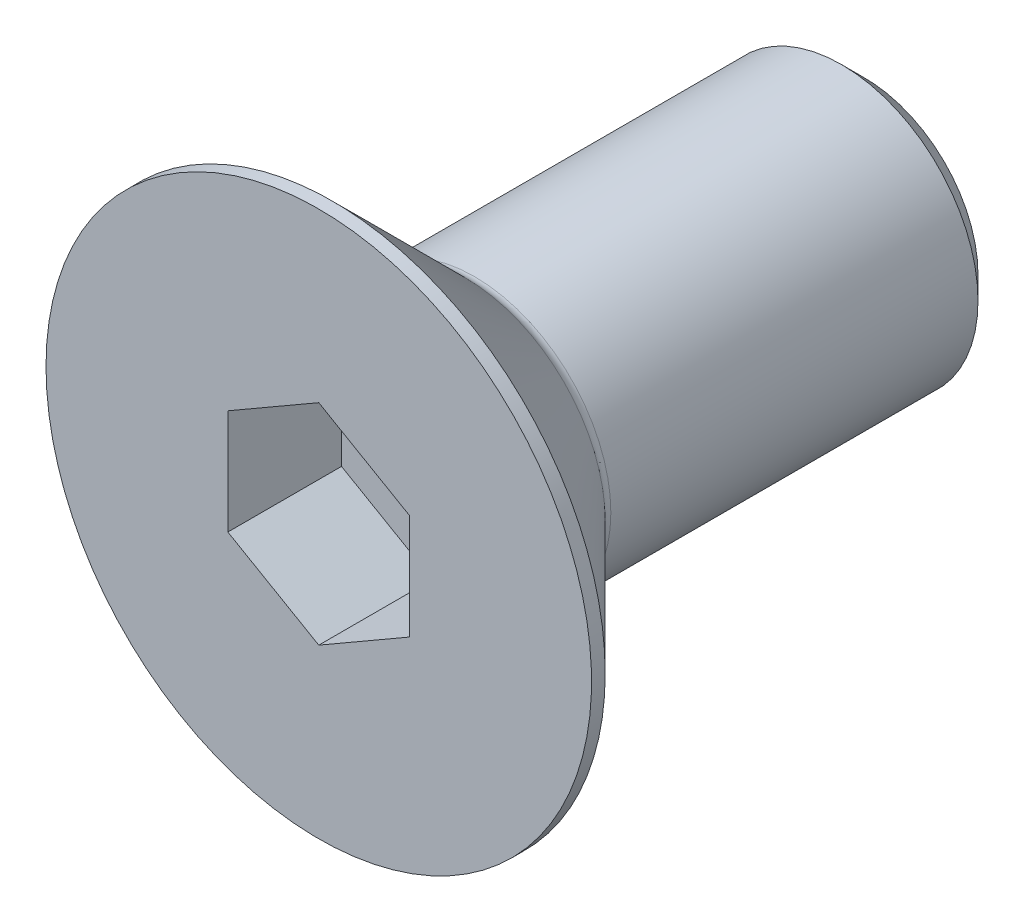
ISO-10303-21;
HEADER;
FILE_DESCRIPTION(('STEP AP214'),'2;1');
FILE_NAME('part.step','',(''),(''),'','','');
FILE_SCHEMA(('AUTOMOTIVE_DESIGN { 1 0 10303 214 1 1 1 1 }'));
ENDSEC;
DATA;
#1=APPLICATION_CONTEXT('core data for automotive mechanical design processes');
#2=APPLICATION_PROTOCOL_DEFINITION('international standard','automotive_design',2000,#1);
#3=PRODUCT_CONTEXT('',#1,'mechanical');
#4=PRODUCT('Part','Part','',(#3));
#5=PRODUCT_RELATED_PRODUCT_CATEGORY('part','',(#4));
#6=PRODUCT_DEFINITION_FORMATION('','',#4);
#7=PRODUCT_DEFINITION_CONTEXT('part definition',#1,'design');
#8=PRODUCT_DEFINITION('design','',#6,#7);
#9=PRODUCT_DEFINITION_SHAPE('','',#8);
#10=(LENGTH_UNIT() NAMED_UNIT(*) SI_UNIT(.MILLI.,.METRE.));
#11=(NAMED_UNIT(*) PLANE_ANGLE_UNIT() SI_UNIT($,.RADIAN.));
#12=(NAMED_UNIT(*) SI_UNIT($,.STERADIAN.) SOLID_ANGLE_UNIT());
#13=UNCERTAINTY_MEASURE_WITH_UNIT(LENGTH_MEASURE(1.E-05),#10,'distance_accuracy_value','');
#14=(GEOMETRIC_REPRESENTATION_CONTEXT(3) GLOBAL_UNCERTAINTY_ASSIGNED_CONTEXT((#13)) GLOBAL_UNIT_ASSIGNED_CONTEXT((#10,
#11,#12)) REPRESENTATION_CONTEXT('',''));
#15=CARTESIAN_POINT('',(0.,0.,0.));
#16=DIRECTION('',(0.,0.,1.));
#17=DIRECTION('',(1.,0.,0.));
#18=AXIS2_PLACEMENT_3D('',#15,#16,#17);
#19=CARTESIAN_POINT('',(0.,0.,-2.5));
#20=DIRECTION('',(0.,0.,1.));
#21=DIRECTION('',(1.,0.,0.));
#22=AXIS2_PLACEMENT_3D('',#19,#20,#21);
#23=PLANE('',#22);
#24=DIRECTION('',(-0.866025403784439,-0.5,0.));
#25=VECTOR('',#24,1.);
#26=CARTESIAN_POINT('',(0.,2.3094010767585,-2.5));
#27=LINE('',#26,#25);
#28=CARTESIAN_POINT('',(0.,2.3094010767585,-2.5));
#29=VERTEX_POINT('',#28);
#30=CARTESIAN_POINT('',(-2.,1.15470053837925,-2.5));
#31=VERTEX_POINT('',#30);
#32=EDGE_CURVE('E83',#29,#31,#27,.T.);
#33=ORIENTED_EDGE('',*,*,#32,.T.);
#34=DIRECTION('',(0.,1.,0.));
#35=VECTOR('',#34,1.);
#36=CARTESIAN_POINT('',(-2.,1.15470053837925,-2.5));
#37=LINE('',#36,#35);
#38=CARTESIAN_POINT('',(-2.,-1.15470053837925,-2.5));
#39=VERTEX_POINT('',#38);
#40=EDGE_CURVE('E67',#31,#39,#37,.F.);
#41=ORIENTED_EDGE('',*,*,#40,.T.);
#42=DIRECTION('',(0.866025403784439,-0.499999999999999,0.));
#43=VECTOR('',#42,1.);
#44=CARTESIAN_POINT('',(-2.,-1.15470053837925,-2.5));
#45=LINE('',#44,#43);
#46=CARTESIAN_POINT('',(0.,-2.3094010767585,-2.5));
#47=VERTEX_POINT('',#46);
#48=EDGE_CURVE('E72',#39,#47,#45,.T.);
#49=ORIENTED_EDGE('',*,*,#48,.T.);
#50=DIRECTION('',(0.866025403784439,0.5,0.));
#51=VECTOR('',#50,1.);
#52=CARTESIAN_POINT('',(0.,-2.3094010767585,-2.5));
#53=LINE('',#52,#51);
#54=CARTESIAN_POINT('',(2.,-1.15470053837925,-2.5));
#55=VERTEX_POINT('',#54);
#56=EDGE_CURVE('E129',#47,#55,#53,.T.);
#57=ORIENTED_EDGE('',*,*,#56,.T.);
#58=DIRECTION('',(0.,1.,0.));
#59=VECTOR('',#58,1.);
#60=CARTESIAN_POINT('',(2.,-1.15470053837925,-2.5));
#61=LINE('',#60,#59);
#62=CARTESIAN_POINT('',(2.,1.15470053837925,-2.5));
#63=VERTEX_POINT('',#62);
#64=EDGE_CURVE('E133',#55,#63,#61,.T.);
#65=ORIENTED_EDGE('',*,*,#64,.T.);
#66=DIRECTION('',(-0.866025403784439,0.499999999999999,0.));
#67=VECTOR('',#66,1.);
#68=CARTESIAN_POINT('',(2.,1.15470053837925,-2.5));
#69=LINE('',#68,#67);
#70=EDGE_CURVE('E138',#63,#29,#69,.T.);
#71=ORIENTED_EDGE('',*,*,#70,.T.);
#72=EDGE_LOOP('',(#33,#41,#49,#57,#65,#71));
#73=FACE_BOUND('',#72,.T.);
#74=ADVANCED_FACE('F16',(#73),#23,.T.);
#75=CARTESIAN_POINT('',(-2.,-1.15470053837925,0.));
#76=DIRECTION('',(-0.499999999999999,-0.866025403784439,0.));
#77=DIRECTION('',(0.866025403784439,-0.499999999999999,0.));
#78=AXIS2_PLACEMENT_3D('',#75,#76,#77);
#79=PLANE('',#78);
#80=DIRECTION('',(0.,0.,1.));
#81=VECTOR('',#80,1.);
#82=CARTESIAN_POINT('',(-2.,-1.15470053837925,0.));
#83=LINE('',#82,#81);
#84=CARTESIAN_POINT('',(-2.,-1.15470053837925,0.));
#85=VERTEX_POINT('',#84);
#86=EDGE_CURVE('E74',#39,#85,#83,.T.);
#87=ORIENTED_EDGE('',*,*,#86,.T.);
#88=DIRECTION('',(-0.866025403784439,0.499999999999999,0.));
#89=VECTOR('',#88,1.);
#90=CARTESIAN_POINT('',(0.,-2.3094010767585,0.));
#91=LINE('',#90,#89);
#92=CARTESIAN_POINT('',(0.,-2.3094010767585,0.));
#93=VERTEX_POINT('',#92);
#94=EDGE_CURVE('E127',#93,#85,#91,.T.);
#95=ORIENTED_EDGE('',*,*,#94,.F.);
#96=DIRECTION('',(0.,0.,1.));
#97=VECTOR('',#96,1.);
#98=CARTESIAN_POINT('',(0.,-2.3094010767585,0.));
#99=LINE('',#98,#97);
#100=EDGE_CURVE('E77',#93,#47,#99,.F.);
#101=ORIENTED_EDGE('',*,*,#100,.T.);
#102=ORIENTED_EDGE('',*,*,#48,.F.);
#103=EDGE_LOOP('',(#87,#95,#101,#102));
#104=FACE_BOUND('',#103,.T.);
#105=ADVANCED_FACE('F73',(#104),#79,.F.);
#106=CARTESIAN_POINT('',(-2.,1.15470053837925,0.));
#107=DIRECTION('',(-1.,0.,0.));
#108=DIRECTION('',(0.,0.,1.));
#109=AXIS2_PLACEMENT_3D('',#106,#107,#108);
#110=PLANE('',#109);
#111=DIRECTION('',(0.,0.,1.));
#112=VECTOR('',#111,1.);
#113=CARTESIAN_POINT('',(-2.,1.15470053837925,0.));
#114=LINE('',#113,#112);
#115=CARTESIAN_POINT('',(-2.,1.15470053837925,0.));
#116=VERTEX_POINT('',#115);
#117=EDGE_CURVE('E85',#31,#116,#114,.T.);
#118=ORIENTED_EDGE('',*,*,#117,.T.);
#119=DIRECTION('',(0.,1.,0.));
#120=VECTOR('',#119,1.);
#121=CARTESIAN_POINT('',(-2.,0.,0.));
#122=LINE('',#121,#120);
#123=EDGE_CURVE('E89',#85,#116,#122,.T.);
#124=ORIENTED_EDGE('',*,*,#123,.F.);
#125=ORIENTED_EDGE('',*,*,#86,.F.);
#126=ORIENTED_EDGE('',*,*,#40,.F.);
#127=EDGE_LOOP('',(#118,#124,#125,#126));
#128=FACE_BOUND('',#127,.T.);
#129=ADVANCED_FACE('F87',(#128),#110,.F.);
#130=CARTESIAN_POINT('',(0.,2.3094010767585,0.));
#131=DIRECTION('',(-0.5,0.866025403784439,0.));
#132=DIRECTION('',(-0.866025403784439,-0.5,0.));
#133=AXIS2_PLACEMENT_3D('',#130,#131,#132);
#134=PLANE('',#133);
#135=DIRECTION('',(0.,0.,1.));
#136=VECTOR('',#135,1.);
#137=CARTESIAN_POINT('',(0.,2.3094010767585,0.));
#138=LINE('',#137,#136);
#139=CARTESIAN_POINT('',(0.,2.3094010767585,0.));
#140=VERTEX_POINT('',#139);
#141=EDGE_CURVE('E140',#29,#140,#138,.T.);
#142=ORIENTED_EDGE('',*,*,#141,.T.);
#143=DIRECTION('',(0.866025403784439,0.5,0.));
#144=VECTOR('',#143,1.);
#145=CARTESIAN_POINT('',(-2.,1.15470053837925,0.));
#146=LINE('',#145,#144);
#147=EDGE_CURVE('E123',#116,#140,#146,.T.);
#148=ORIENTED_EDGE('',*,*,#147,.F.);
#149=ORIENTED_EDGE('',*,*,#117,.F.);
#150=ORIENTED_EDGE('',*,*,#32,.F.);
#151=EDGE_LOOP('',(#142,#148,#149,#150));
#152=FACE_BOUND('',#151,.T.);
#153=ADVANCED_FACE('F144',(#152),#134,.F.);
#154=CARTESIAN_POINT('',(2.,1.15470053837925,0.));
#155=DIRECTION('',(0.499999999999999,0.866025403784439,0.));
#156=DIRECTION('',(-0.866025403784439,0.499999999999999,0.));
#157=AXIS2_PLACEMENT_3D('',#154,#155,#156);
#158=PLANE('',#157);
#159=DIRECTION('',(0.,0.,-1.));
#160=VECTOR('',#159,1.);
#161=CARTESIAN_POINT('',(2.,1.15470053837925,0.));
#162=LINE('',#161,#160);
#163=CARTESIAN_POINT('',(2.,1.15470053837925,0.));
#164=VERTEX_POINT('',#163);
#165=EDGE_CURVE('E136',#63,#164,#162,.F.);
#166=ORIENTED_EDGE('',*,*,#165,.T.);
#167=DIRECTION('',(0.866025403784439,-0.499999999999999,0.));
#168=VECTOR('',#167,1.);
#169=CARTESIAN_POINT('',(0.,2.3094010767585,0.));
#170=LINE('',#169,#168);
#171=EDGE_CURVE('E120',#140,#164,#170,.T.);
#172=ORIENTED_EDGE('',*,*,#171,.F.);
#173=ORIENTED_EDGE('',*,*,#141,.F.);
#174=ORIENTED_EDGE('',*,*,#70,.F.);
#175=EDGE_LOOP('',(#166,#172,#173,#174));
#176=FACE_BOUND('',#175,.T.);
#177=ADVANCED_FACE('F155',(#176),#158,.F.);
#178=CARTESIAN_POINT('',(2.,-1.15470053837925,0.));
#179=DIRECTION('',(1.,0.,0.));
#180=DIRECTION('',(0.,0.,-1.));
#181=AXIS2_PLACEMENT_3D('',#178,#179,#180);
#182=PLANE('',#181);
#183=DIRECTION('',(0.,0.,1.));
#184=VECTOR('',#183,1.);
#185=CARTESIAN_POINT('',(2.,-1.15470053837925,0.));
#186=LINE('',#185,#184);
#187=CARTESIAN_POINT('',(2.,-1.15470053837925,0.));
#188=VERTEX_POINT('',#187);
#189=EDGE_CURVE('E35',#55,#188,#186,.T.);
#190=ORIENTED_EDGE('',*,*,#189,.T.);
#191=DIRECTION('',(0.,1.,0.));
#192=VECTOR('',#191,1.);
#193=CARTESIAN_POINT('',(2.,0.,0.));
#194=LINE('',#193,#192);
#195=EDGE_CURVE('E117',#164,#188,#194,.F.);
#196=ORIENTED_EDGE('',*,*,#195,.F.);
#197=ORIENTED_EDGE('',*,*,#165,.F.);
#198=ORIENTED_EDGE('',*,*,#64,.F.);
#199=EDGE_LOOP('',(#190,#196,#197,#198));
#200=FACE_BOUND('',#199,.T.);
#201=ADVANCED_FACE('F153',(#200),#182,.F.);
#202=CARTESIAN_POINT('',(0.,-2.3094010767585,0.));
#203=DIRECTION('',(0.5,-0.866025403784439,0.));
#204=DIRECTION('',(0.866025403784439,0.5,0.));
#205=AXIS2_PLACEMENT_3D('',#202,#203,#204);
#206=PLANE('',#205);
#207=ORIENTED_EDGE('',*,*,#100,.F.);
#208=DIRECTION('',(-0.866025403784439,-0.5,0.));
#209=VECTOR('',#208,1.);
#210=CARTESIAN_POINT('',(2.,-1.15470053837925,0.));
#211=LINE('',#210,#209);
#212=EDGE_CURVE('E114',#188,#93,#211,.T.);
#213=ORIENTED_EDGE('',*,*,#212,.F.);
#214=ORIENTED_EDGE('',*,*,#189,.F.);
#215=ORIENTED_EDGE('',*,*,#56,.F.);
#216=EDGE_LOOP('',(#207,#213,#214,#215));
#217=FACE_BOUND('',#216,.T.);
#218=ADVANCED_FACE('F151',(#217),#206,.F.);
#219=CARTESIAN_POINT('',(3.,0.,0.));
#220=DIRECTION('',(0.,0.,1.));
#221=DIRECTION('',(1.,0.,0.));
#222=AXIS2_PLACEMENT_3D('',#219,#220,#221);
#223=PLANE('',#222);
#224=ORIENTED_EDGE('',*,*,#195,.T.);
#225=ORIENTED_EDGE('',*,*,#212,.T.);
#226=ORIENTED_EDGE('',*,*,#94,.T.);
#227=ORIENTED_EDGE('',*,*,#123,.T.);
#228=ORIENTED_EDGE('',*,*,#147,.T.);
#229=ORIENTED_EDGE('',*,*,#171,.T.);
#230=EDGE_LOOP('',(#224,#225,#226,#227,#228,#229));
#231=FACE_BOUND('',#230,.T.);
#232=CARTESIAN_POINT('',(0.,0.,0.));
#233=DIRECTION('',(0.,0.,-1.));
#234=DIRECTION('',(-1.,0.,0.));
#235=AXIS2_PLACEMENT_3D('',#232,#233,#234);
#236=CIRCLE('',#235,6.);
#237=CARTESIAN_POINT('',(-6.,0.,0.));
#238=VERTEX_POINT('',#237);
#239=EDGE_CURVE('E20',#238,#238,#236,.T.);
#240=ORIENTED_EDGE('',*,*,#239,.F.);
#241=EDGE_LOOP('',(#240));
#242=FACE_BOUND('',#241,.T.);
#243=ADVANCED_FACE('F148',(#231,#242),#223,.T.);
#244=CARTESIAN_POINT('',(0.,0.,-0.150000000000001));
#245=DIRECTION('',(0.,0.,-1.));
#246=DIRECTION('',(-1.,0.,0.));
#247=AXIS2_PLACEMENT_3D('',#244,#245,#246);
#248=CYLINDRICAL_SURFACE('',#247,6.);
#249=ORIENTED_EDGE('',*,*,#239,.T.);
#250=EDGE_LOOP('',(#249));
#251=FACE_BOUND('',#250,.T.);
#252=CARTESIAN_POINT('',(0.,0.,-0.299999998617295));
#253=DIRECTION('',(0.,0.,1.));
#254=DIRECTION('',(1.,0.,0.));
#255=AXIS2_PLACEMENT_3D('',#252,#253,#254);
#256=CIRCLE('',#255,5.99999999872125);
#257=CARTESIAN_POINT('',(5.99999999872125,0.,-0.299999998617295));
#258=VERTEX_POINT('',#257);
#259=EDGE_CURVE('E101',#258,#258,#256,.F.);
#260=ORIENTED_EDGE('',*,*,#259,.F.);
#261=EDGE_LOOP('',(#260));
#262=FACE_BOUND('',#261,.T.);
#263=ADVANCED_FACE('F183',(#251,#262),#248,.T.);
#264=CARTESIAN_POINT('',(0.,0.,-0.299999998617295));
#265=DIRECTION('',(0.,0.,1.));
#266=DIRECTION('',(1.,0.,0.));
#267=AXIS2_PLACEMENT_3D('',#264,#265,#266);
#268=CONICAL_SURFACE('',#267,5.99999999872125,0.78539816249955);
#269=CARTESIAN_POINT('',(0.,0.,-3.21213203435596));
#270=DIRECTION('',(0.,0.,-1.));
#271=DIRECTION('',(0.,1.,0.));
#272=AXIS2_PLACEMENT_3D('',#269,#270,#271);
#273=CIRCLE('',#272,3.08786796564404);
#274=CARTESIAN_POINT('',(0.,3.08786796564404,-3.21213203435596));
#275=VERTEX_POINT('',#274);
#276=EDGE_CURVE('E95',#275,#275,#273,.T.);
#277=ORIENTED_EDGE('',*,*,#276,.F.);
#278=EDGE_LOOP('',(#277));
#279=FACE_BOUND('',#278,.T.);
#280=ORIENTED_EDGE('',*,*,#259,.T.);
#281=EDGE_LOOP('',(#280));
#282=FACE_BOUND('',#281,.T.);
#283=ADVANCED_FACE('F179',(#279,#282),#268,.T.);
#284=CARTESIAN_POINT('',(1.5,0.,-12.));
#285=DIRECTION('',(0.,0.,-1.));
#286=DIRECTION('',(-1.,0.,0.));
#287=AXIS2_PLACEMENT_3D('',#284,#285,#286);
#288=PLANE('',#287);
#289=CARTESIAN_POINT('',(0.,0.,-12.000000000171));
#290=DIRECTION('',(0.,0.,1.));
#291=DIRECTION('',(1.,0.,0.));
#292=AXIS2_PLACEMENT_3D('',#289,#290,#291);
#293=CIRCLE('',#292,2.5000000002251);
#294=CARTESIAN_POINT('',(2.5000000002251,0.,-12.000000000171));
#295=VERTEX_POINT('',#294);
#296=EDGE_CURVE('E93',#295,#295,#293,.T.);
#297=ORIENTED_EDGE('',*,*,#296,.F.);
#298=EDGE_LOOP('',(#297));
#299=FACE_BOUND('',#298,.T.);
#300=ADVANCED_FACE('F176',(#299),#288,.T.);
#301=CARTESIAN_POINT('',(0.,0.,-3.42426406871193));
#302=DIRECTION('',(0.,0.,-1.));
#303=DIRECTION('',(-1.,0.,0.));
#304=AXIS2_PLACEMENT_3D('',#301,#302,#303);
#305=TOROIDAL_SURFACE('',#304,3.3,0.3);
#306=CARTESIAN_POINT('',(0.,0.,-3.42426406871193));
#307=DIRECTION('',(0.,0.,-1.));
#308=DIRECTION('',(-1.,0.,0.));
#309=AXIS2_PLACEMENT_3D('',#306,#307,#308);
#310=CIRCLE('',#309,3.);
#311=CARTESIAN_POINT('',(-3.,0.,-3.42426406871193));
#312=VERTEX_POINT('',#311);
#313=EDGE_CURVE('E26',#312,#312,#310,.T.);
#314=ORIENTED_EDGE('',*,*,#313,.F.);
#315=EDGE_LOOP('',(#314));
#316=FACE_BOUND('',#315,.T.);
#317=ORIENTED_EDGE('',*,*,#276,.T.);
#318=EDGE_LOOP('',(#317));
#319=FACE_BOUND('',#318,.T.);
#320=ADVANCED_FACE('F18',(#316,#319),#305,.F.);
#321=CARTESIAN_POINT('',(0.,0.,-11.4999999997281));
#322=DIRECTION('',(0.,0.,1.));
#323=DIRECTION('',(1.,0.,0.));
#324=AXIS2_PLACEMENT_3D('',#321,#322,#323);
#325=CONICAL_SURFACE('',#324,2.99999999975853,0.785398162487954);
#326=ORIENTED_EDGE('',*,*,#296,.T.);
#327=EDGE_LOOP('',(#326));
#328=FACE_BOUND('',#327,.T.);
#329=CARTESIAN_POINT('',(0.,0.,-11.5));
#330=DIRECTION('',(0.,0.,-1.));
#331=DIRECTION('',(-1.,0.,0.));
#332=AXIS2_PLACEMENT_3D('',#329,#330,#331);
#333=CIRCLE('',#332,3.);
#334=CARTESIAN_POINT('',(-3.,0.,-11.5));
#335=VERTEX_POINT('',#334);
#336=EDGE_CURVE('E11',#335,#335,#333,.F.);
#337=ORIENTED_EDGE('',*,*,#336,.F.);
#338=EDGE_LOOP('',(#337));
#339=FACE_BOUND('',#338,.T.);
#340=ADVANCED_FACE('F167',(#328,#339),#325,.T.);
#341=CARTESIAN_POINT('',(0.,0.,-7.65));
#342=DIRECTION('',(0.,0.,-1.));
#343=DIRECTION('',(-1.,0.,0.));
#344=AXIS2_PLACEMENT_3D('',#341,#342,#343);
#345=CYLINDRICAL_SURFACE('',#344,3.);
#346=ORIENTED_EDGE('',*,*,#336,.T.);
#347=EDGE_LOOP('',(#346));
#348=FACE_BOUND('',#347,.T.);
#349=ORIENTED_EDGE('',*,*,#313,.T.);
#350=EDGE_LOOP('',(#349));
#351=FACE_BOUND('',#350,.T.);
#352=ADVANCED_FACE('F165',(#348,#351),#345,.T.);
#353=CLOSED_SHELL('',(#74,#105,#129,#153,#177,#201,#218,#243,#263,#283,#300,#320,#340,#352));
#354=MANIFOLD_SOLID_BREP('B1',#353);
#355=ADVANCED_BREP_SHAPE_REPRESENTATION('',(#18,#354),#14);
#356=SHAPE_DEFINITION_REPRESENTATION(#9,#355);
ENDSEC;
END-ISO-10303-21;
